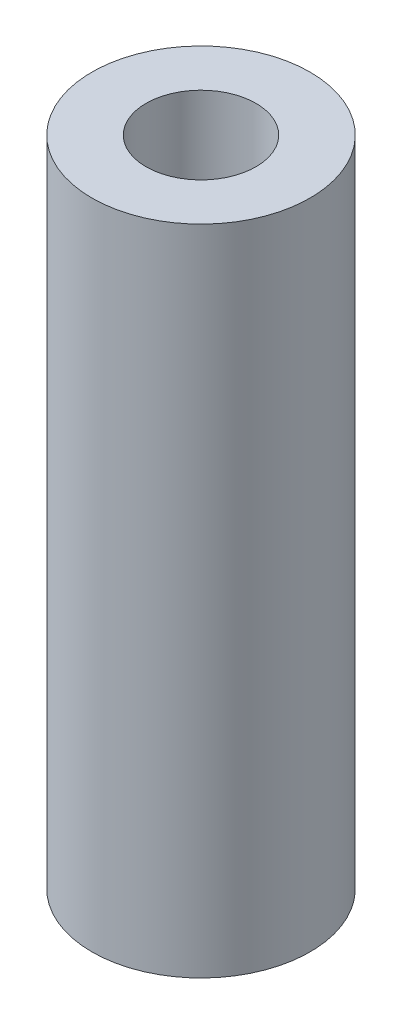
ISO-10303-21;
HEADER;
FILE_DESCRIPTION(('STEP AP214'),'2;1');
FILE_NAME('part.step','',(''),(''),'','','');
FILE_SCHEMA(('AUTOMOTIVE_DESIGN { 1 0 10303 214 1 1 1 1 }'));
ENDSEC;
DATA;
#1=APPLICATION_CONTEXT('core data for automotive mechanical design processes');
#2=APPLICATION_PROTOCOL_DEFINITION('international standard','automotive_design',2000,#1);
#3=PRODUCT_CONTEXT('',#1,'mechanical');
#4=PRODUCT('Part','Part','',(#3));
#5=PRODUCT_RELATED_PRODUCT_CATEGORY('part','',(#4));
#6=PRODUCT_DEFINITION_FORMATION('','',#4);
#7=PRODUCT_DEFINITION_CONTEXT('part definition',#1,'design');
#8=PRODUCT_DEFINITION('design','',#6,#7);
#9=PRODUCT_DEFINITION_SHAPE('','',#8);
#10=(LENGTH_UNIT() NAMED_UNIT(*) SI_UNIT(.MILLI.,.METRE.));
#11=(NAMED_UNIT(*) PLANE_ANGLE_UNIT() SI_UNIT($,.RADIAN.));
#12=(NAMED_UNIT(*) SI_UNIT($,.STERADIAN.) SOLID_ANGLE_UNIT());
#13=UNCERTAINTY_MEASURE_WITH_UNIT(LENGTH_MEASURE(1.E-05),#10,'distance_accuracy_value','');
#14=(GEOMETRIC_REPRESENTATION_CONTEXT(3) GLOBAL_UNCERTAINTY_ASSIGNED_CONTEXT((#13)) GLOBAL_UNIT_ASSIGNED_CONTEXT((#10,
#11,#12)) REPRESENTATION_CONTEXT('',''));
#15=CARTESIAN_POINT('',(0.,0.,0.));
#16=DIRECTION('',(0.,0.,1.));
#17=DIRECTION('',(1.,0.,0.));
#18=AXIS2_PLACEMENT_3D('',#15,#16,#17);
#19=CARTESIAN_POINT('',(0.,14.25,0.));
#20=DIRECTION('',(0.,1.,0.));
#21=DIRECTION('',(0.,0.,1.));
#22=AXIS2_PLACEMENT_3D('',#19,#20,#21);
#23=PLANE('',#22);
#24=CARTESIAN_POINT('',(0.,14.25,0.));
#25=DIRECTION('',(0.,1.,0.));
#26=DIRECTION('',(0.,0.,1.));
#27=AXIS2_PLACEMENT_3D('',#24,#25,#26);
#28=CIRCLE('',#27,4.7625);
#29=CARTESIAN_POINT('',(0.,14.25,4.7625));
#30=VERTEX_POINT('',#29);
#31=EDGE_CURVE('E10',#30,#30,#28,.T.);
#32=ORIENTED_EDGE('',*,*,#31,.T.);
#33=EDGE_LOOP('',(#32));
#34=FACE_BOUND('',#33,.T.);
#35=CARTESIAN_POINT('',(0.,14.25,0.));
#36=DIRECTION('',(0.,1.,0.));
#37=DIRECTION('',(0.,0.,1.));
#38=AXIS2_PLACEMENT_3D('',#35,#36,#37);
#39=CIRCLE('',#38,2.4);
#40=CARTESIAN_POINT('',(0.,14.25,2.4));
#41=VERTEX_POINT('',#40);
#42=EDGE_CURVE('E47',#41,#41,#39,.T.);
#43=ORIENTED_EDGE('',*,*,#42,.F.);
#44=EDGE_LOOP('',(#43));
#45=FACE_BOUND('',#44,.T.);
#46=ADVANCED_FACE('F36',(#34,#45),#23,.T.);
#47=CARTESIAN_POINT('',(0.,-14.25,0.));
#48=DIRECTION('',(0.,1.,0.));
#49=DIRECTION('',(0.,0.,1.));
#50=AXIS2_PLACEMENT_3D('',#47,#48,#49);
#51=PLANE('',#50);
#52=CARTESIAN_POINT('',(0.,-14.25,0.));
#53=DIRECTION('',(0.,1.,0.));
#54=DIRECTION('',(0.,0.,1.));
#55=AXIS2_PLACEMENT_3D('',#52,#53,#54);
#56=CIRCLE('',#55,4.7625);
#57=CARTESIAN_POINT('',(0.,-14.25,4.7625));
#58=VERTEX_POINT('',#57);
#59=EDGE_CURVE('E40',#58,#58,#56,.T.);
#60=ORIENTED_EDGE('',*,*,#59,.F.);
#61=EDGE_LOOP('',(#60));
#62=FACE_BOUND('',#61,.T.);
#63=CARTESIAN_POINT('',(0.,-14.25,0.));
#64=DIRECTION('',(0.,1.,0.));
#65=DIRECTION('',(0.,0.,1.));
#66=AXIS2_PLACEMENT_3D('',#63,#64,#65);
#67=CIRCLE('',#66,2.4);
#68=CARTESIAN_POINT('',(0.,-14.25,2.4));
#69=VERTEX_POINT('',#68);
#70=EDGE_CURVE('E49',#69,#69,#67,.T.);
#71=ORIENTED_EDGE('',*,*,#70,.T.);
#72=EDGE_LOOP('',(#71));
#73=FACE_BOUND('',#72,.T.);
#74=ADVANCED_FACE('F59',(#62,#73),#51,.F.);
#75=CARTESIAN_POINT('',(0.,14.25,0.));
#76=DIRECTION('',(0.,-1.,0.));
#77=DIRECTION('',(0.,0.,-1.));
#78=AXIS2_PLACEMENT_3D('',#75,#76,#77);
#79=CYLINDRICAL_SURFACE('',#78,4.7625);
#80=ORIENTED_EDGE('',*,*,#31,.F.);
#81=EDGE_LOOP('',(#80));
#82=FACE_BOUND('',#81,.T.);
#83=ORIENTED_EDGE('',*,*,#59,.T.);
#84=EDGE_LOOP('',(#83));
#85=FACE_BOUND('',#84,.T.);
#86=ADVANCED_FACE('F38',(#82,#85),#79,.T.);
#87=CARTESIAN_POINT('',(0.,14.25,0.));
#88=DIRECTION('',(0.,-1.,0.));
#89=DIRECTION('',(0.,0.,-1.));
#90=AXIS2_PLACEMENT_3D('',#87,#88,#89);
#91=CYLINDRICAL_SURFACE('',#90,2.4);
#92=ORIENTED_EDGE('',*,*,#42,.T.);
#93=EDGE_LOOP('',(#92));
#94=FACE_BOUND('',#93,.T.);
#95=ORIENTED_EDGE('',*,*,#70,.F.);
#96=EDGE_LOOP('',(#95));
#97=FACE_BOUND('',#96,.T.);
#98=ADVANCED_FACE('F55',(#94,#97),#91,.F.);
#99=CLOSED_SHELL('',(#46,#74,#86,#98));
#100=MANIFOLD_SOLID_BREP('B2',#99);
#101=ADVANCED_BREP_SHAPE_REPRESENTATION('',(#18,#100),#14);
#102=SHAPE_DEFINITION_REPRESENTATION(#9,#101);
ENDSEC;
END-ISO-10303-21;
